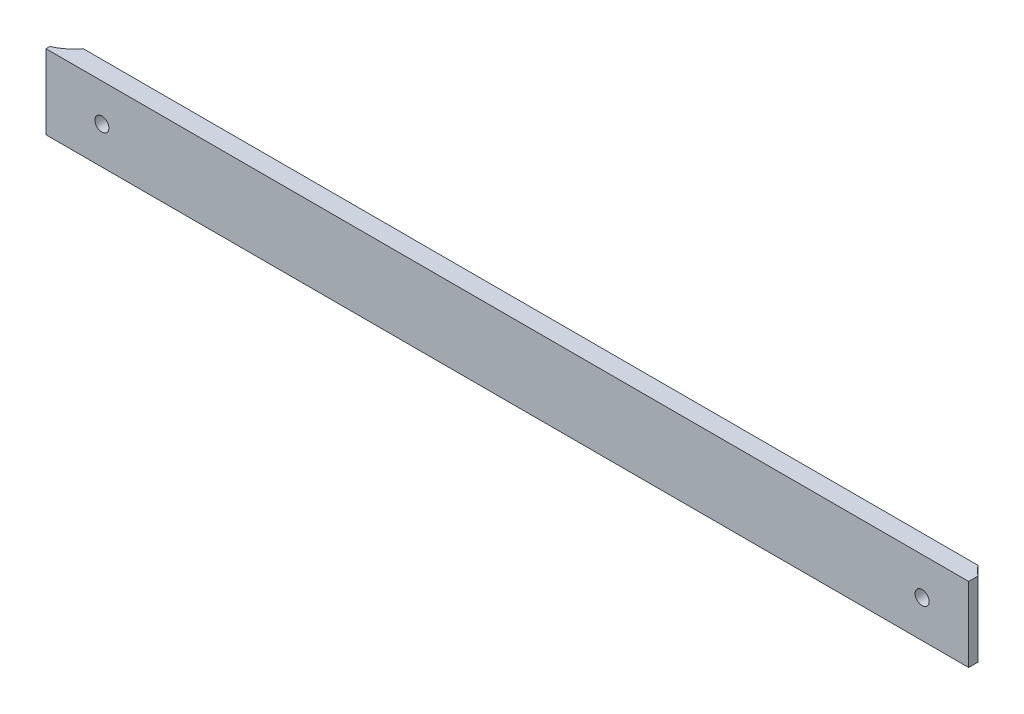
ISO-10303-21;
HEADER;
FILE_DESCRIPTION(('STEP AP214'),'2;1');
FILE_NAME('part.step','',(''),(''),'','','');
FILE_SCHEMA(('AUTOMOTIVE_DESIGN { 1 0 10303 214 1 1 1 1 }'));
ENDSEC;
DATA;
#1=APPLICATION_CONTEXT('core data for automotive mechanical design processes');
#2=APPLICATION_PROTOCOL_DEFINITION('international standard','automotive_design',2000,#1);
#3=PRODUCT_CONTEXT('',#1,'mechanical');
#4=PRODUCT('Part','Part','',(#3));
#5=PRODUCT_RELATED_PRODUCT_CATEGORY('part','',(#4));
#6=PRODUCT_DEFINITION_FORMATION('','',#4);
#7=PRODUCT_DEFINITION_CONTEXT('part definition',#1,'design');
#8=PRODUCT_DEFINITION('design','',#6,#7);
#9=PRODUCT_DEFINITION_SHAPE('','',#8);
#10=(LENGTH_UNIT() NAMED_UNIT(*) SI_UNIT(.MILLI.,.METRE.));
#11=(NAMED_UNIT(*) PLANE_ANGLE_UNIT() SI_UNIT($,.RADIAN.));
#12=(NAMED_UNIT(*) SI_UNIT($,.STERADIAN.) SOLID_ANGLE_UNIT());
#13=UNCERTAINTY_MEASURE_WITH_UNIT(LENGTH_MEASURE(1.E-05),#10,'distance_accuracy_value','');
#14=(GEOMETRIC_REPRESENTATION_CONTEXT(3) GLOBAL_UNCERTAINTY_ASSIGNED_CONTEXT((#13)) GLOBAL_UNIT_ASSIGNED_CONTEXT((#10,
#11,#12)) REPRESENTATION_CONTEXT('',''));
#15=CARTESIAN_POINT('',(0.,0.,0.));
#16=DIRECTION('',(0.,0.,1.));
#17=DIRECTION('',(1.,0.,0.));
#18=AXIS2_PLACEMENT_3D('',#15,#16,#17);
#19=CARTESIAN_POINT('',(-158.75,12.7,15.875));
#20=DIRECTION('',(0.,0.,-1.));
#21=DIRECTION('',(-1.,0.,0.));
#22=AXIS2_PLACEMENT_3D('',#19,#20,#21);
#23=PLANE('',#22);
#24=DIRECTION('',(1.,0.,0.));
#25=VECTOR('',#24,1.);
#26=CARTESIAN_POINT('',(-158.75,-12.7,15.875));
#27=LINE('',#26,#25);
#28=CARTESIAN_POINT('',(-158.75,-12.7,15.875));
#29=VERTEX_POINT('',#28);
#30=CARTESIAN_POINT('',(155.575,-12.7,15.875));
#31=VERTEX_POINT('',#30);
#32=EDGE_CURVE('E124',#29,#31,#27,.T.);
#33=ORIENTED_EDGE('',*,*,#32,.T.);
#34=DIRECTION('',(0.,-1.,0.));
#35=VECTOR('',#34,1.);
#36=CARTESIAN_POINT('',(155.575,12.7,15.875));
#37=LINE('',#36,#35);
#38=CARTESIAN_POINT('',(155.575,12.7,15.875));
#39=VERTEX_POINT('',#38);
#40=EDGE_CURVE('E109',#39,#31,#37,.T.);
#41=ORIENTED_EDGE('',*,*,#40,.F.);
#42=DIRECTION('',(1.,0.,0.));
#43=VECTOR('',#42,1.);
#44=CARTESIAN_POINT('',(-158.75,12.7,15.875));
#45=LINE('',#44,#43);
#46=CARTESIAN_POINT('',(-158.75,12.7,15.875));
#47=VERTEX_POINT('',#46);
#48=EDGE_CURVE('E100',#47,#39,#45,.T.);
#49=ORIENTED_EDGE('',*,*,#48,.F.);
#50=DIRECTION('',(0.,-1.,0.));
#51=VECTOR('',#50,1.);
#52=CARTESIAN_POINT('',(-158.75,12.7,15.875));
#53=LINE('',#52,#51);
#54=EDGE_CURVE('E42',#47,#29,#53,.T.);
#55=ORIENTED_EDGE('',*,*,#54,.T.);
#56=EDGE_LOOP('',(#33,#41,#49,#55));
#57=FACE_BOUND('',#56,.T.);
#58=CARTESIAN_POINT('',(139.7,0.,15.875));
#59=DIRECTION('',(0.,0.,1.));
#60=DIRECTION('',(1.,0.,0.));
#61=AXIS2_PLACEMENT_3D('',#58,#59,#60);
#62=CIRCLE('',#61,2.38125);
#63=CARTESIAN_POINT('',(142.08125,0.,15.875));
#64=VERTEX_POINT('',#63);
#65=EDGE_CURVE('E227',#64,#64,#62,.T.);
#66=ORIENTED_EDGE('',*,*,#65,.F.);
#67=EDGE_LOOP('',(#66));
#68=FACE_BOUND('',#67,.T.);
#69=CARTESIAN_POINT('',(-139.7,0.,15.875));
#70=DIRECTION('',(0.,0.,1.));
#71=DIRECTION('',(1.,0.,0.));
#72=AXIS2_PLACEMENT_3D('',#69,#70,#71);
#73=CIRCLE('',#72,2.38125);
#74=CARTESIAN_POINT('',(-137.31875,0.,15.875));
#75=VERTEX_POINT('',#74);
#76=EDGE_CURVE('E224',#75,#75,#73,.T.);
#77=ORIENTED_EDGE('',*,*,#76,.F.);
#78=EDGE_LOOP('',(#77));
#79=FACE_BOUND('',#78,.T.);
#80=ADVANCED_FACE('F33',(#57,#68,#79),#23,.F.);
#81=CARTESIAN_POINT('',(-165.1,12.7,0.));
#82=DIRECTION('',(0.,-1.,0.));
#83=DIRECTION('',(0.,0.,-1.));
#84=AXIS2_PLACEMENT_3D('',#81,#82,#83);
#85=CYLINDRICAL_SURFACE('',#84,15.875);
#86=CARTESIAN_POINT('',(-165.1,-12.7,0.));
#87=DIRECTION('',(0.,-1.,0.));
#88=DIRECTION('',(0.,0.,1.));
#89=AXIS2_PLACEMENT_3D('',#86,#87,#88);
#90=CIRCLE('',#89,15.875);
#91=CARTESIAN_POINT('',(-152.4,-12.7,9.525));
#92=VERTEX_POINT('',#91);
#93=CARTESIAN_POINT('',(-158.75,-12.7,14.5496778314848));
#94=VERTEX_POINT('',#93);
#95=EDGE_CURVE('E118',#92,#94,#90,.T.);
#96=ORIENTED_EDGE('',*,*,#95,.T.);
#97=DIRECTION('',(0.,-1.,0.));
#98=VECTOR('',#97,1.);
#99=CARTESIAN_POINT('',(-158.75,12.7,14.5496778314848));
#100=LINE('',#99,#98);
#101=CARTESIAN_POINT('',(-158.75,12.7,14.5496778314848));
#102=VERTEX_POINT('',#101);
#103=EDGE_CURVE('E11',#102,#94,#100,.T.);
#104=ORIENTED_EDGE('',*,*,#103,.F.);
#105=CARTESIAN_POINT('',(-165.1,12.7,0.));
#106=DIRECTION('',(0.,-1.,0.));
#107=DIRECTION('',(0.,0.,1.));
#108=AXIS2_PLACEMENT_3D('',#105,#106,#107);
#109=CIRCLE('',#108,15.875);
#110=CARTESIAN_POINT('',(-152.4,12.7,9.525));
#111=VERTEX_POINT('',#110);
#112=EDGE_CURVE('E129',#111,#102,#109,.T.);
#113=ORIENTED_EDGE('',*,*,#112,.F.);
#114=DIRECTION('',(0.,-1.,0.));
#115=VECTOR('',#114,1.);
#116=CARTESIAN_POINT('',(-152.4,12.7,9.525));
#117=LINE('',#116,#115);
#118=EDGE_CURVE('E114',#111,#92,#117,.T.);
#119=ORIENTED_EDGE('',*,*,#118,.T.);
#120=EDGE_LOOP('',(#96,#104,#113,#119));
#121=FACE_BOUND('',#120,.T.);
#122=ADVANCED_FACE('F35',(#121),#85,.F.);
#123=CARTESIAN_POINT('',(-158.75,12.7,14.5496778314848));
#124=DIRECTION('',(1.,0.,0.));
#125=DIRECTION('',(0.,0.,-1.));
#126=AXIS2_PLACEMENT_3D('',#123,#124,#125);
#127=PLANE('',#126);
#128=DIRECTION('',(0.,0.,1.));
#129=VECTOR('',#128,1.);
#130=CARTESIAN_POINT('',(-158.75,-12.7,14.5496778314848));
#131=LINE('',#130,#129);
#132=EDGE_CURVE('E121',#94,#29,#131,.T.);
#133=ORIENTED_EDGE('',*,*,#132,.T.);
#134=ORIENTED_EDGE('',*,*,#54,.F.);
#135=DIRECTION('',(0.,0.,1.));
#136=VECTOR('',#135,1.);
#137=CARTESIAN_POINT('',(-158.75,12.7,14.5496778314848));
#138=LINE('',#137,#136);
#139=EDGE_CURVE('E87',#102,#47,#138,.T.);
#140=ORIENTED_EDGE('',*,*,#139,.F.);
#141=ORIENTED_EDGE('',*,*,#103,.T.);
#142=EDGE_LOOP('',(#133,#134,#140,#141));
#143=FACE_BOUND('',#142,.T.);
#144=ADVANCED_FACE('F160',(#143),#127,.F.);
#145=CARTESIAN_POINT('',(155.575,12.7,12.7));
#146=DIRECTION('',(-1.,0.,0.));
#147=DIRECTION('',(0.,0.,1.));
#148=AXIS2_PLACEMENT_3D('',#145,#146,#147);
#149=PLANE('',#148);
#150=DIRECTION('',(0.,0.,-1.));
#151=VECTOR('',#150,1.);
#152=CARTESIAN_POINT('',(155.575,-12.7,12.7));
#153=LINE('',#152,#151);
#154=CARTESIAN_POINT('',(155.575,-12.7,12.7));
#155=VERTEX_POINT('',#154);
#156=EDGE_CURVE('E108',#31,#155,#153,.T.);
#157=ORIENTED_EDGE('',*,*,#156,.T.);
#158=DIRECTION('',(0.,-1.,0.));
#159=VECTOR('',#158,1.);
#160=CARTESIAN_POINT('',(155.575,12.7,12.7));
#161=LINE('',#160,#159);
#162=CARTESIAN_POINT('',(155.575,12.7,12.7));
#163=VERTEX_POINT('',#162);
#164=EDGE_CURVE('E105',#163,#155,#161,.T.);
#165=ORIENTED_EDGE('',*,*,#164,.F.);
#166=DIRECTION('',(0.,0.,-1.));
#167=VECTOR('',#166,1.);
#168=CARTESIAN_POINT('',(155.575,12.7,12.7));
#169=LINE('',#168,#167);
#170=EDGE_CURVE('E94',#39,#163,#169,.T.);
#171=ORIENTED_EDGE('',*,*,#170,.F.);
#172=ORIENTED_EDGE('',*,*,#40,.T.);
#173=EDGE_LOOP('',(#157,#165,#171,#172));
#174=FACE_BOUND('',#173,.T.);
#175=ADVANCED_FACE('F106',(#174),#149,.F.);
#176=CARTESIAN_POINT('',(165.1,12.7,0.));
#177=DIRECTION('',(0.,-1.,0.));
#178=DIRECTION('',(0.,0.,-1.));
#179=AXIS2_PLACEMENT_3D('',#176,#177,#178);
#180=CYLINDRICAL_SURFACE('',#179,15.875);
#181=CARTESIAN_POINT('',(165.1,-12.7,0.));
#182=DIRECTION('',(0.,-1.,0.));
#183=DIRECTION('',(0.,0.,-1.));
#184=AXIS2_PLACEMENT_3D('',#181,#182,#183);
#185=CIRCLE('',#184,15.875);
#186=CARTESIAN_POINT('',(152.4,-12.7,9.52499999999997));
#187=VERTEX_POINT('',#186);
#188=EDGE_CURVE('E73',#155,#187,#185,.T.);
#189=ORIENTED_EDGE('',*,*,#188,.T.);
#190=DIRECTION('',(0.,-1.,0.));
#191=VECTOR('',#190,1.);
#192=CARTESIAN_POINT('',(152.4,12.7,9.52499999999997));
#193=LINE('',#192,#191);
#194=CARTESIAN_POINT('',(152.4,12.7,9.52499999999997));
#195=VERTEX_POINT('',#194);
#196=EDGE_CURVE('E110',#195,#187,#193,.T.);
#197=ORIENTED_EDGE('',*,*,#196,.F.);
#198=CARTESIAN_POINT('',(165.1,12.7,0.));
#199=DIRECTION('',(0.,-1.,0.));
#200=DIRECTION('',(0.,0.,-1.));
#201=AXIS2_PLACEMENT_3D('',#198,#199,#200);
#202=CIRCLE('',#201,15.875);
#203=EDGE_CURVE('E98',#163,#195,#202,.T.);
#204=ORIENTED_EDGE('',*,*,#203,.F.);
#205=ORIENTED_EDGE('',*,*,#164,.T.);
#206=EDGE_LOOP('',(#189,#197,#204,#205));
#207=FACE_BOUND('',#206,.T.);
#208=ADVANCED_FACE('F112',(#207),#180,.F.);
#209=CARTESIAN_POINT('',(-152.4,12.7,9.525));
#210=DIRECTION('',(0.,0.,1.));
#211=DIRECTION('',(1.,0.,0.));
#212=AXIS2_PLACEMENT_3D('',#209,#210,#211);
#213=PLANE('',#212);
#214=CARTESIAN_POINT('',(-139.7,0.,9.52499999999997));
#215=DIRECTION('',(0.,0.,1.));
#216=DIRECTION('',(1.,0.,0.));
#217=AXIS2_PLACEMENT_3D('',#214,#215,#216);
#218=CIRCLE('',#217,2.38125);
#219=CARTESIAN_POINT('',(-137.31875,0.,9.52499999999997));
#220=VERTEX_POINT('',#219);
#221=EDGE_CURVE('E221',#220,#220,#218,.T.);
#222=ORIENTED_EDGE('',*,*,#221,.T.);
#223=EDGE_LOOP('',(#222));
#224=FACE_BOUND('',#223,.T.);
#225=CARTESIAN_POINT('',(139.7,0.,9.52499999999997));
#226=DIRECTION('',(0.,0.,1.));
#227=DIRECTION('',(1.,0.,0.));
#228=AXIS2_PLACEMENT_3D('',#225,#226,#227);
#229=CIRCLE('',#228,2.38125);
#230=CARTESIAN_POINT('',(142.08125,0.,9.52499999999997));
#231=VERTEX_POINT('',#230);
#232=EDGE_CURVE('E122',#231,#231,#229,.T.);
#233=ORIENTED_EDGE('',*,*,#232,.T.);
#234=EDGE_LOOP('',(#233));
#235=FACE_BOUND('',#234,.T.);
#236=DIRECTION('',(-1.,0.,0.));
#237=VECTOR('',#236,1.);
#238=CARTESIAN_POINT('',(-152.4,-12.7,9.525));
#239=LINE('',#238,#237);
#240=EDGE_CURVE('E79',#187,#92,#239,.T.);
#241=ORIENTED_EDGE('',*,*,#240,.T.);
#242=ORIENTED_EDGE('',*,*,#118,.F.);
#243=DIRECTION('',(-1.,0.,0.));
#244=VECTOR('',#243,1.);
#245=CARTESIAN_POINT('',(-152.4,12.7,9.525));
#246=LINE('',#245,#244);
#247=EDGE_CURVE('E50',#195,#111,#246,.T.);
#248=ORIENTED_EDGE('',*,*,#247,.F.);
#249=ORIENTED_EDGE('',*,*,#196,.T.);
#250=EDGE_LOOP('',(#241,#242,#248,#249));
#251=FACE_BOUND('',#250,.T.);
#252=ADVANCED_FACE('F142',(#224,#235,#251),#213,.F.);
#253=CARTESIAN_POINT('',(-165.1,12.7,0.));
#254=DIRECTION('',(0.,1.,0.));
#255=DIRECTION('',(0.,0.,1.));
#256=AXIS2_PLACEMENT_3D('',#253,#254,#255);
#257=PLANE('',#256);
#258=ORIENTED_EDGE('',*,*,#112,.T.);
#259=ORIENTED_EDGE('',*,*,#139,.T.);
#260=ORIENTED_EDGE('',*,*,#48,.T.);
#261=ORIENTED_EDGE('',*,*,#170,.T.);
#262=ORIENTED_EDGE('',*,*,#203,.T.);
#263=ORIENTED_EDGE('',*,*,#247,.T.);
#264=EDGE_LOOP('',(#258,#259,#260,#261,#262,#263));
#265=FACE_BOUND('',#264,.T.);
#266=ADVANCED_FACE('F96',(#265),#257,.T.);
#267=CARTESIAN_POINT('',(-165.1,-12.7,0.));
#268=DIRECTION('',(0.,1.,0.));
#269=DIRECTION('',(0.,0.,1.));
#270=AXIS2_PLACEMENT_3D('',#267,#268,#269);
#271=PLANE('',#270);
#272=ORIENTED_EDGE('',*,*,#95,.F.);
#273=ORIENTED_EDGE('',*,*,#240,.F.);
#274=ORIENTED_EDGE('',*,*,#188,.F.);
#275=ORIENTED_EDGE('',*,*,#156,.F.);
#276=ORIENTED_EDGE('',*,*,#32,.F.);
#277=ORIENTED_EDGE('',*,*,#132,.F.);
#278=EDGE_LOOP('',(#272,#273,#274,#275,#276,#277));
#279=FACE_BOUND('',#278,.T.);
#280=ADVANCED_FACE('F138',(#279),#271,.F.);
#281=CARTESIAN_POINT('',(139.7,0.,15.875));
#282=DIRECTION('',(0.,0.,1.));
#283=DIRECTION('',(1.,0.,0.));
#284=AXIS2_PLACEMENT_3D('',#281,#282,#283);
#285=CYLINDRICAL_SURFACE('',#284,2.38125);
#286=ORIENTED_EDGE('',*,*,#232,.F.);
#287=EDGE_LOOP('',(#286));
#288=FACE_BOUND('',#287,.T.);
#289=ORIENTED_EDGE('',*,*,#65,.T.);
#290=EDGE_LOOP('',(#289));
#291=FACE_BOUND('',#290,.T.);
#292=ADVANCED_FACE('F187',(#288,#291),#285,.F.);
#293=CARTESIAN_POINT('',(-139.7,0.,15.875));
#294=DIRECTION('',(0.,0.,1.));
#295=DIRECTION('',(1.,0.,0.));
#296=AXIS2_PLACEMENT_3D('',#293,#294,#295);
#297=CYLINDRICAL_SURFACE('',#296,2.38125);
#298=ORIENTED_EDGE('',*,*,#221,.F.);
#299=EDGE_LOOP('',(#298));
#300=FACE_BOUND('',#299,.T.);
#301=ORIENTED_EDGE('',*,*,#76,.T.);
#302=EDGE_LOOP('',(#301));
#303=FACE_BOUND('',#302,.T.);
#304=ADVANCED_FACE('F205',(#300,#303),#297,.F.);
#305=CLOSED_SHELL('',(#80,#122,#144,#175,#208,#252,#266,#280,#292,#304));
#306=MANIFOLD_SOLID_BREP('B2',#305);
#307=ADVANCED_BREP_SHAPE_REPRESENTATION('',(#18,#306),#14);
#308=SHAPE_DEFINITION_REPRESENTATION(#9,#307);
ENDSEC;
END-ISO-10303-21;
